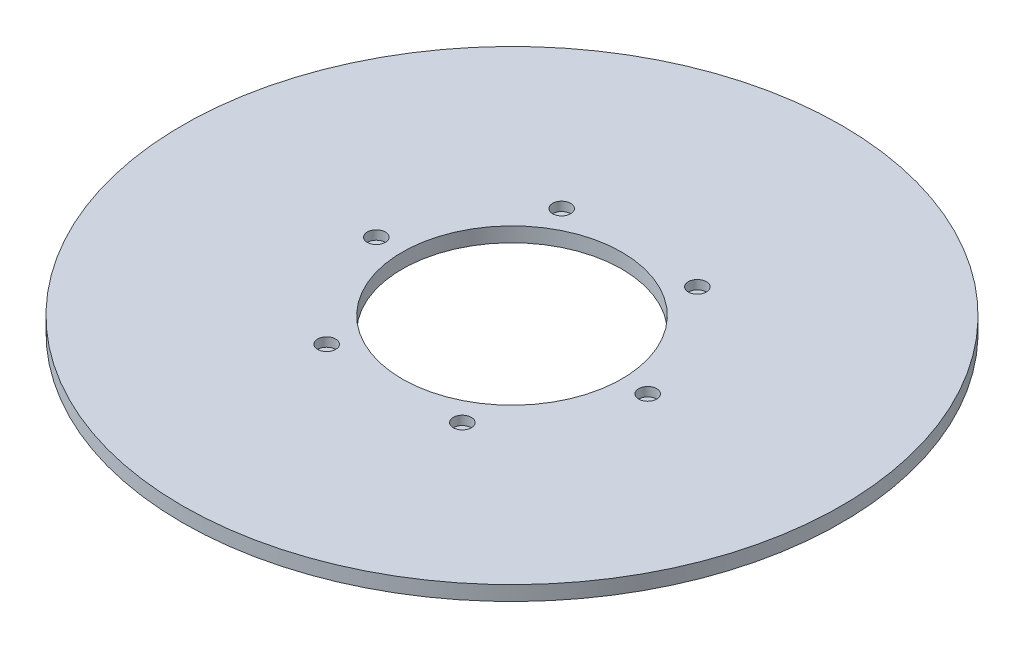
ISO-10303-21;
HEADER;
FILE_DESCRIPTION(('STEP AP214'),'2;1');
FILE_NAME('part.step','',(''),(''),'','','');
FILE_SCHEMA(('AUTOMOTIVE_DESIGN { 1 0 10303 214 1 1 1 1 }'));
ENDSEC;
DATA;
#1=APPLICATION_CONTEXT('core data for automotive mechanical design processes');
#2=APPLICATION_PROTOCOL_DEFINITION('international standard','automotive_design',2000,#1);
#3=PRODUCT_CONTEXT('',#1,'mechanical');
#4=PRODUCT('Part','Part','',(#3));
#5=PRODUCT_RELATED_PRODUCT_CATEGORY('part','',(#4));
#6=PRODUCT_DEFINITION_FORMATION('','',#4);
#7=PRODUCT_DEFINITION_CONTEXT('part definition',#1,'design');
#8=PRODUCT_DEFINITION('design','',#6,#7);
#9=PRODUCT_DEFINITION_SHAPE('','',#8);
#10=(LENGTH_UNIT() NAMED_UNIT(*) SI_UNIT(.MILLI.,.METRE.));
#11=(NAMED_UNIT(*) PLANE_ANGLE_UNIT() SI_UNIT($,.RADIAN.));
#12=(NAMED_UNIT(*) SI_UNIT($,.STERADIAN.) SOLID_ANGLE_UNIT());
#13=UNCERTAINTY_MEASURE_WITH_UNIT(LENGTH_MEASURE(1.E-05),#10,'distance_accuracy_value','');
#14=(GEOMETRIC_REPRESENTATION_CONTEXT(3) GLOBAL_UNCERTAINTY_ASSIGNED_CONTEXT((#13)) GLOBAL_UNIT_ASSIGNED_CONTEXT((#10,
#11,#12)) REPRESENTATION_CONTEXT('',''));
#15=CARTESIAN_POINT('',(0.,0.,0.));
#16=DIRECTION('',(0.,0.,1.));
#17=DIRECTION('',(1.,0.,0.));
#18=AXIS2_PLACEMENT_3D('',#15,#16,#17);
#19=CARTESIAN_POINT('',(0.,4.,0.));
#20=DIRECTION('',(0.,-1.,0.));
#21=DIRECTION('',(0.,0.,-1.));
#22=AXIS2_PLACEMENT_3D('',#19,#20,#21);
#23=CYLINDRICAL_SURFACE('',#22,90.);
#24=CARTESIAN_POINT('',(0.,4.,0.));
#25=DIRECTION('',(0.,1.,0.));
#26=DIRECTION('',(0.,0.,1.));
#27=AXIS2_PLACEMENT_3D('',#24,#25,#26);
#28=CIRCLE('',#27,90.);
#29=CARTESIAN_POINT('',(0.,4.,90.));
#30=VERTEX_POINT('',#29);
#31=EDGE_CURVE('E10',#30,#30,#28,.T.);
#32=ORIENTED_EDGE('',*,*,#31,.F.);
#33=EDGE_LOOP('',(#32));
#34=FACE_BOUND('',#33,.T.);
#35=CARTESIAN_POINT('',(0.,0.,0.));
#36=DIRECTION('',(0.,1.,0.));
#37=DIRECTION('',(0.,0.,1.));
#38=AXIS2_PLACEMENT_3D('',#35,#36,#37);
#39=CIRCLE('',#38,90.);
#40=CARTESIAN_POINT('',(0.,0.,90.));
#41=VERTEX_POINT('',#40);
#42=EDGE_CURVE('E37',#41,#41,#39,.T.);
#43=ORIENTED_EDGE('',*,*,#42,.T.);
#44=EDGE_LOOP('',(#43));
#45=FACE_BOUND('',#44,.T.);
#46=ADVANCED_FACE('F40',(#34,#45),#23,.T.);
#47=CARTESIAN_POINT('',(0.,4.,0.));
#48=DIRECTION('',(0.,1.,0.));
#49=DIRECTION('',(0.,0.,1.));
#50=AXIS2_PLACEMENT_3D('',#47,#48,#49);
#51=PLANE('',#50);
#52=CARTESIAN_POINT('',(-18.5282718116548,4.,-32.0919081542315));
#53=DIRECTION('',(0.,1.,0.));
#54=DIRECTION('',(-0.866025403784433,0.,0.50000000000001));
#55=AXIS2_PLACEMENT_3D('',#52,#53,#54);
#56=CIRCLE('',#55,2.46890591203106);
#57=CARTESIAN_POINT('',(-18.5282718116548,4.,-29.6230022422005));
#58=VERTEX_POINT('',#57);
#59=EDGE_CURVE('E70',#58,#58,#56,.T.);
#60=ORIENTED_EDGE('',*,*,#59,.F.);
#61=EDGE_LOOP('',(#60));
#62=FACE_BOUND('',#61,.T.);
#63=CARTESIAN_POINT('',(18.5282718116542,4.,-32.0919081542319));
#64=DIRECTION('',(0.,1.,0.));
#65=DIRECTION('',(-0.866025403784443,0.,-0.499999999999992));
#66=AXIS2_PLACEMENT_3D('',#63,#64,#65);
#67=CIRCLE('',#66,2.46890591203106);
#68=CARTESIAN_POINT('',(18.5282718116542,4.,-29.6230022422009));
#69=VERTEX_POINT('',#68);
#70=EDGE_CURVE('E71',#69,#69,#67,.T.);
#71=ORIENTED_EDGE('',*,*,#70,.F.);
#72=EDGE_LOOP('',(#71));
#73=FACE_BOUND('',#72,.T.);
#74=CARTESIAN_POINT('',(37.0565436233089,4.,0.));
#75=DIRECTION('',(0.,1.,0.));
#76=DIRECTION('',(0.,0.,-1.));
#77=AXIS2_PLACEMENT_3D('',#74,#75,#76);
#78=CIRCLE('',#77,2.46890591203106);
#79=CARTESIAN_POINT('',(37.0565436233089,4.,2.46890591203106));
#80=VERTEX_POINT('',#79);
#81=EDGE_CURVE('E78',#80,#80,#78,.T.);
#82=ORIENTED_EDGE('',*,*,#81,.F.);
#83=EDGE_LOOP('',(#82));
#84=FACE_BOUND('',#83,.T.);
#85=CARTESIAN_POINT('',(18.5282718116546,4.,32.0919081542317));
#86=DIRECTION('',(0.,1.,0.));
#87=DIRECTION('',(0.866025403784436,0.,-0.500000000000004));
#88=AXIS2_PLACEMENT_3D('',#85,#86,#87);
#89=CIRCLE('',#88,2.46890591203106);
#90=CARTESIAN_POINT('',(18.5282718116546,4.,34.5608140662628));
#91=VERTEX_POINT('',#90);
#92=EDGE_CURVE('E84',#91,#91,#89,.T.);
#93=ORIENTED_EDGE('',*,*,#92,.F.);
#94=EDGE_LOOP('',(#93));
#95=FACE_BOUND('',#94,.T.);
#96=CARTESIAN_POINT('',(-18.5282718116544,4.,32.0919081542318));
#97=DIRECTION('',(0.,1.,0.));
#98=DIRECTION('',(0.86602540378444,0.,0.499999999999998));
#99=AXIS2_PLACEMENT_3D('',#96,#97,#98);
#100=CIRCLE('',#99,2.46890591203106);
#101=CARTESIAN_POINT('',(-18.5282718116544,4.,34.5608140662629));
#102=VERTEX_POINT('',#101);
#103=EDGE_CURVE('E61',#102,#102,#100,.T.);
#104=ORIENTED_EDGE('',*,*,#103,.F.);
#105=EDGE_LOOP('',(#104));
#106=FACE_BOUND('',#105,.T.);
#107=CARTESIAN_POINT('',(-37.0565436233089,4.,0.));
#108=DIRECTION('',(0.,1.,0.));
#109=DIRECTION('',(0.,0.,1.));
#110=AXIS2_PLACEMENT_3D('',#107,#108,#109);
#111=CIRCLE('',#110,2.46890591203106);
#112=CARTESIAN_POINT('',(-37.0565436233089,4.,2.46890591203106));
#113=VERTEX_POINT('',#112);
#114=EDGE_CURVE('E54',#113,#113,#111,.T.);
#115=ORIENTED_EDGE('',*,*,#114,.F.);
#116=EDGE_LOOP('',(#115));
#117=FACE_BOUND('',#116,.T.);
#118=CARTESIAN_POINT('',(0.,4.,0.));
#119=DIRECTION('',(0.,1.,0.));
#120=DIRECTION('',(0.,0.,1.));
#121=AXIS2_PLACEMENT_3D('',#118,#119,#120);
#122=CIRCLE('',#121,30.);
#123=CARTESIAN_POINT('',(0.,4.,30.));
#124=VERTEX_POINT('',#123);
#125=EDGE_CURVE('E50',#124,#124,#122,.T.);
#126=ORIENTED_EDGE('',*,*,#125,.F.);
#127=EDGE_LOOP('',(#126));
#128=FACE_BOUND('',#127,.T.);
#129=ORIENTED_EDGE('',*,*,#31,.T.);
#130=EDGE_LOOP('',(#129));
#131=FACE_BOUND('',#130,.T.);
#132=ADVANCED_FACE('F99',(#62,#73,#84,#95,#106,#117,#128,#131),#51,.T.);
#133=CARTESIAN_POINT('',(0.,0.,0.));
#134=DIRECTION('',(0.,1.,0.));
#135=DIRECTION('',(0.,0.,1.));
#136=AXIS2_PLACEMENT_3D('',#133,#134,#135);
#137=PLANE('',#136);
#138=CARTESIAN_POINT('',(0.,0.,0.));
#139=DIRECTION('',(0.,1.,0.));
#140=DIRECTION('',(0.,0.,1.));
#141=AXIS2_PLACEMENT_3D('',#138,#139,#140);
#142=CIRCLE('',#141,30.);
#143=CARTESIAN_POINT('',(0.,0.,30.));
#144=VERTEX_POINT('',#143);
#145=EDGE_CURVE('E47',#144,#144,#142,.T.);
#146=ORIENTED_EDGE('',*,*,#145,.T.);
#147=EDGE_LOOP('',(#146));
#148=FACE_BOUND('',#147,.T.);
#149=ORIENTED_EDGE('',*,*,#42,.F.);
#150=EDGE_LOOP('',(#149));
#151=FACE_BOUND('',#150,.T.);
#152=ADVANCED_FACE('F103',(#148,#151),#137,.F.);
#153=CARTESIAN_POINT('',(0.,4.,0.));
#154=DIRECTION('',(0.,-1.,0.));
#155=DIRECTION('',(0.,0.,-1.));
#156=AXIS2_PLACEMENT_3D('',#153,#154,#155);
#157=CYLINDRICAL_SURFACE('',#156,30.);
#158=ORIENTED_EDGE('',*,*,#125,.T.);
#159=EDGE_LOOP('',(#158));
#160=FACE_BOUND('',#159,.T.);
#161=ORIENTED_EDGE('',*,*,#145,.F.);
#162=EDGE_LOOP('',(#161));
#163=FACE_BOUND('',#162,.T.);
#164=ADVANCED_FACE('F115',(#160,#163),#157,.F.);
#165=CARTESIAN_POINT('',(-37.0565436233089,1.5405980535547,0.));
#166=DIRECTION('',(0.,1.,0.));
#167=DIRECTION('',(0.,0.,1.));
#168=AXIS2_PLACEMENT_3D('',#165,#166,#167);
#169=CYLINDRICAL_SURFACE('',#168,2.46890591203106);
#170=CARTESIAN_POINT('',(-37.0565436233089,1.5405980535547,0.));
#171=DIRECTION('',(0.,1.,0.));
#172=DIRECTION('',(0.,0.,1.));
#173=AXIS2_PLACEMENT_3D('',#170,#171,#172);
#174=CIRCLE('',#173,2.46890591203106);
#175=CARTESIAN_POINT('',(-37.0565436233089,1.5405980535547,2.46890591203106));
#176=VERTEX_POINT('',#175);
#177=EDGE_CURVE('E55',#176,#176,#174,.T.);
#178=CARTESIAN_POINT('',(-37.0565436233089,1.5405980535547,2.46890591203106));
#179=CARTESIAN_POINT('',(-37.0565436233089,1.56621682383017,2.46890591203106));
#180=CARTESIAN_POINT('',(-37.0565436233089,1.59183559410565,2.46890591203106));
#181=CARTESIAN_POINT('',(-37.0565436233089,1.64307313465659,2.46890591203106));
#182=CARTESIAN_POINT('',(-37.0565436233089,1.66869190493206,2.46890591203106));
#183=CARTESIAN_POINT('',(-37.0565436233089,1.71992944548301,2.46890591203106));
#184=CARTESIAN_POINT('',(-37.0565436233089,1.74554821575848,2.46890591203106));
#185=CARTESIAN_POINT('',(-37.0565436233089,1.79678575630942,2.46890591203106));
#186=CARTESIAN_POINT('',(-37.0565436233089,1.82240452658489,2.46890591203106));
#187=CARTESIAN_POINT('',(-37.0565436233089,1.87364206713584,2.46890591203106));
#188=CARTESIAN_POINT('',(-37.0565436233089,1.89926083741131,2.46890591203106));
#189=CARTESIAN_POINT('',(-37.0565436233089,1.95049837796225,2.46890591203106));
#190=CARTESIAN_POINT('',(-37.0565436233089,1.97611714823772,2.46890591203106));
#191=CARTESIAN_POINT('',(-37.0565436233089,2.02735468878867,2.46890591203106));
#192=CARTESIAN_POINT('',(-37.0565436233089,2.05297345906414,2.46890591203106));
#193=CARTESIAN_POINT('',(-37.0565436233089,2.10421099961508,2.46890591203106));
#194=CARTESIAN_POINT('',(-37.0565436233089,2.12982976989055,2.46890591203106));
#195=CARTESIAN_POINT('',(-37.0565436233089,2.1810673104415,2.46890591203106));
#196=CARTESIAN_POINT('',(-37.0565436233089,2.20668608071697,2.46890591203106));
#197=CARTESIAN_POINT('',(-37.0565436233089,2.25792362126791,2.46890591203106));
#198=CARTESIAN_POINT('',(-37.0565436233089,2.28354239154339,2.46890591203106));
#199=CARTESIAN_POINT('',(-37.0565436233089,2.33477993209433,2.46890591203106));
#200=CARTESIAN_POINT('',(-37.0565436233089,2.3603987023698,2.46890591203106));
#201=CARTESIAN_POINT('',(-37.0565436233089,2.41163624292074,2.46890591203106));
#202=CARTESIAN_POINT('',(-37.0565436233089,2.43725501319622,2.46890591203106));
#203=CARTESIAN_POINT('',(-37.0565436233089,2.48849255374716,2.46890591203106));
#204=CARTESIAN_POINT('',(-37.0565436233089,2.51411132402263,2.46890591203106));
#205=CARTESIAN_POINT('',(-37.0565436233089,2.56534886457358,2.46890591203106));
#206=CARTESIAN_POINT('',(-37.0565436233089,2.59096763484905,2.46890591203106));
#207=CARTESIAN_POINT('',(-37.0565436233089,2.64220517539999,2.46890591203106));
#208=CARTESIAN_POINT('',(-37.0565436233089,2.66782394567546,2.46890591203106));
#209=CARTESIAN_POINT('',(-37.0565436233089,2.71906148622641,2.46890591203106));
#210=CARTESIAN_POINT('',(-37.0565436233089,2.74468025650188,2.46890591203106));
#211=CARTESIAN_POINT('',(-37.0565436233089,2.79591779705282,2.46890591203106));
#212=CARTESIAN_POINT('',(-37.0565436233089,2.82153656732829,2.46890591203106));
#213=CARTESIAN_POINT('',(-37.0565436233089,2.87277410787924,2.46890591203106));
#214=CARTESIAN_POINT('',(-37.0565436233089,2.89839287815471,2.46890591203106));
#215=CARTESIAN_POINT('',(-37.0565436233089,2.94963041870565,2.46890591203106));
#216=CARTESIAN_POINT('',(-37.0565436233089,2.97524918898113,2.46890591203106));
#217=CARTESIAN_POINT('',(-37.0565436233089,3.02648672953207,2.46890591203106));
#218=CARTESIAN_POINT('',(-37.0565436233089,3.05210549980754,2.46890591203106));
#219=CARTESIAN_POINT('',(-37.0565436233089,3.10334304035848,2.46890591203106));
#220=CARTESIAN_POINT('',(-37.0565436233089,3.12896181063396,2.46890591203106));
#221=CARTESIAN_POINT('',(-37.0565436233089,3.1801993511849,2.46890591203106));
#222=CARTESIAN_POINT('',(-37.0565436233089,3.20581812146037,2.46890591203106));
#223=CARTESIAN_POINT('',(-37.0565436233089,3.25705566201132,2.46890591203106));
#224=CARTESIAN_POINT('',(-37.0565436233089,3.28267443228679,2.46890591203106));
#225=CARTESIAN_POINT('',(-37.0565436233089,3.33391197283773,2.46890591203106));
#226=CARTESIAN_POINT('',(-37.0565436233089,3.3595307431132,2.46890591203106));
#227=CARTESIAN_POINT('',(-37.0565436233089,3.41076828366415,2.46890591203106));
#228=CARTESIAN_POINT('',(-37.0565436233089,3.43638705393962,2.46890591203106));
#229=CARTESIAN_POINT('',(-37.0565436233089,3.48762459449056,2.46890591203106));
#230=CARTESIAN_POINT('',(-37.0565436233089,3.51324336476603,2.46890591203106));
#231=CARTESIAN_POINT('',(-37.0565436233089,3.56448090531698,2.46890591203106));
#232=CARTESIAN_POINT('',(-37.0565436233089,3.59009967559245,2.46890591203106));
#233=CARTESIAN_POINT('',(-37.0565436233089,3.64133721614339,2.46890591203106));
#234=CARTESIAN_POINT('',(-37.0565436233089,3.66695598641887,2.46890591203106));
#235=CARTESIAN_POINT('',(-37.0565436233089,3.71819352696981,2.46890591203106));
#236=CARTESIAN_POINT('',(-37.0565436233089,3.74381229724528,2.46890591203106));
#237=CARTESIAN_POINT('',(-37.0565436233089,3.79504983779622,2.46890591203106));
#238=CARTESIAN_POINT('',(-37.0565436233089,3.8206686080717,2.46890591203106));
#239=CARTESIAN_POINT('',(-37.0565436233089,3.87190614862264,2.46890591203106));
#240=CARTESIAN_POINT('',(-37.0565436233089,3.89752491889811,2.46890591203106));
#241=CARTESIAN_POINT('',(-37.0565436233089,3.94876245944906,2.46890591203106));
#242=CARTESIAN_POINT('',(-37.0565436233089,3.97438122972453,2.46890591203106));
#243=CARTESIAN_POINT('',(-37.0565436233089,4.,2.46890591203106));
#244=B_SPLINE_CURVE_WITH_KNOTS('',3,(#178,#179,#180,#181,#182,#183,#184,#185,#186,#187,#188,
#189,#190,#191,#192,#193,#194,#195,#196,#197,#198,#199,#200,#201,#202,#203,#204,#205,#206,#207,
#208,#209,#210,#211,#212,#213,#214,#215,#216,#217,#218,#219,#220,#221,#222,#223,#224,#225,#226,
#227,#228,#229,#230,#231,#232,#233,#234,#235,#236,#237,#238,#239,#240,#241,#242,#243),
.UNSPECIFIED.,.F.,.F.,(4,2,2,2,2,2,2,2,2,2,2,2,2,2,2,2,2,2,2,2,2,2,2,2,2,2,2,2,2,2,2,2,4),(0.,
0.0768563108264155,0.153712621652831,0.230568932479247,0.307425243305662,0.384281554132078,
0.461137864958493,0.537994175784909,0.614850486611324,0.69170679743774,0.768563108264155,
0.845419419090571,0.922275729916986,0.999132040743402,1.07598835156982,1.15284466239623,
1.22970097322265,1.30655728404906,1.38341359487548,1.46026990570189,1.53712621652831,
1.61398252735473,1.69083883818114,1.76769514900756,1.84455145983397,1.92140777066039,
1.9982640814868,2.07512039231322,2.15197670313963,2.22883301396605,2.30568932479247,
2.38254563561888,2.4594019464453),.UNSPECIFIED.);
#245=EDGE_CURVE('BSEAM113',#176,#113,#244,.T.);
#246=ORIENTED_EDGE('',*,*,#177,.F.);
#247=ORIENTED_EDGE('',*,*,#114,.T.);
#248=ORIENTED_EDGE('',*,*,#245,.T.);
#249=ORIENTED_EDGE('',*,*,#245,.F.);
#250=EDGE_LOOP('',(#246,#248,#247,#249));
#251=FACE_BOUND('',#250,.T.);
#252=ADVANCED_FACE('F113',(#251),#169,.F.);
#253=CARTESIAN_POINT('',(-37.0565436233089,1.5405980535547,0.));
#254=DIRECTION('',(0.,1.,0.));
#255=DIRECTION('',(0.,0.,1.));
#256=AXIS2_PLACEMENT_3D('',#253,#254,#255);
#257=PLANE('',#256);
#258=ORIENTED_EDGE('',*,*,#177,.T.);
#259=EDGE_LOOP('',(#258));
#260=FACE_BOUND('',#259,.T.);
#261=ADVANCED_FACE('F144',(#260),#257,.T.);
#262=CARTESIAN_POINT('',(-18.5282718116544,1.5405980535547,32.0919081542318));
#263=DIRECTION('',(0.,1.,0.));
#264=DIRECTION('',(0.,0.,1.));
#265=AXIS2_PLACEMENT_3D('',#262,#263,#264);
#266=CYLINDRICAL_SURFACE('',#265,2.46890591203106);
#267=CARTESIAN_POINT('',(-18.5282718116544,1.5405980535547,32.0919081542318));
#268=DIRECTION('',(0.,1.,0.));
#269=DIRECTION('',(0.86602540378444,0.,0.499999999999998));
#270=AXIS2_PLACEMENT_3D('',#267,#268,#269);
#271=CIRCLE('',#270,2.46890591203106);
#272=CARTESIAN_POINT('',(-18.5282718116544,1.5405980535547,34.5608140662629));
#273=VERTEX_POINT('',#272);
#274=EDGE_CURVE('E59',#273,#273,#271,.T.);
#275=CARTESIAN_POINT('',(-18.5282718116544,1.5405980535547,34.5608140662629));
#276=CARTESIAN_POINT('',(-18.5282718116544,1.56621682383017,34.5608140662629));
#277=CARTESIAN_POINT('',(-18.5282718116544,1.59183559410565,34.5608140662629));
#278=CARTESIAN_POINT('',(-18.5282718116544,1.64307313465659,34.5608140662629));
#279=CARTESIAN_POINT('',(-18.5282718116544,1.66869190493206,34.5608140662629));
#280=CARTESIAN_POINT('',(-18.5282718116544,1.71992944548301,34.5608140662629));
#281=CARTESIAN_POINT('',(-18.5282718116544,1.74554821575848,34.5608140662629));
#282=CARTESIAN_POINT('',(-18.5282718116544,1.79678575630942,34.5608140662629));
#283=CARTESIAN_POINT('',(-18.5282718116544,1.82240452658489,34.5608140662629));
#284=CARTESIAN_POINT('',(-18.5282718116544,1.87364206713584,34.5608140662629));
#285=CARTESIAN_POINT('',(-18.5282718116544,1.89926083741131,34.5608140662629));
#286=CARTESIAN_POINT('',(-18.5282718116544,1.95049837796225,34.5608140662629));
#287=CARTESIAN_POINT('',(-18.5282718116544,1.97611714823772,34.5608140662629));
#288=CARTESIAN_POINT('',(-18.5282718116544,2.02735468878867,34.5608140662629));
#289=CARTESIAN_POINT('',(-18.5282718116544,2.05297345906414,34.5608140662629));
#290=CARTESIAN_POINT('',(-18.5282718116544,2.10421099961508,34.5608140662629));
#291=CARTESIAN_POINT('',(-18.5282718116544,2.12982976989055,34.5608140662629));
#292=CARTESIAN_POINT('',(-18.5282718116544,2.1810673104415,34.5608140662629));
#293=CARTESIAN_POINT('',(-18.5282718116544,2.20668608071697,34.5608140662629));
#294=CARTESIAN_POINT('',(-18.5282718116544,2.25792362126791,34.5608140662629));
#295=CARTESIAN_POINT('',(-18.5282718116544,2.28354239154339,34.5608140662629));
#296=CARTESIAN_POINT('',(-18.5282718116544,2.33477993209433,34.5608140662629));
#297=CARTESIAN_POINT('',(-18.5282718116544,2.3603987023698,34.5608140662629));
#298=CARTESIAN_POINT('',(-18.5282718116544,2.41163624292074,34.5608140662629));
#299=CARTESIAN_POINT('',(-18.5282718116544,2.43725501319622,34.5608140662629));
#300=CARTESIAN_POINT('',(-18.5282718116544,2.48849255374716,34.5608140662629));
#301=CARTESIAN_POINT('',(-18.5282718116544,2.51411132402263,34.5608140662629));
#302=CARTESIAN_POINT('',(-18.5282718116544,2.56534886457358,34.5608140662629));
#303=CARTESIAN_POINT('',(-18.5282718116544,2.59096763484905,34.5608140662629));
#304=CARTESIAN_POINT('',(-18.5282718116544,2.64220517539999,34.5608140662629));
#305=CARTESIAN_POINT('',(-18.5282718116544,2.66782394567546,34.5608140662629));
#306=CARTESIAN_POINT('',(-18.5282718116544,2.71906148622641,34.5608140662629));
#307=CARTESIAN_POINT('',(-18.5282718116544,2.74468025650188,34.5608140662629));
#308=CARTESIAN_POINT('',(-18.5282718116544,2.79591779705282,34.5608140662629));
#309=CARTESIAN_POINT('',(-18.5282718116544,2.82153656732829,34.5608140662629));
#310=CARTESIAN_POINT('',(-18.5282718116544,2.87277410787924,34.5608140662629));
#311=CARTESIAN_POINT('',(-18.5282718116544,2.89839287815471,34.5608140662629));
#312=CARTESIAN_POINT('',(-18.5282718116544,2.94963041870565,34.5608140662629));
#313=CARTESIAN_POINT('',(-18.5282718116544,2.97524918898113,34.5608140662629));
#314=CARTESIAN_POINT('',(-18.5282718116544,3.02648672953207,34.5608140662629));
#315=CARTESIAN_POINT('',(-18.5282718116544,3.05210549980754,34.5608140662629));
#316=CARTESIAN_POINT('',(-18.5282718116544,3.10334304035848,34.5608140662629));
#317=CARTESIAN_POINT('',(-18.5282718116544,3.12896181063396,34.5608140662629));
#318=CARTESIAN_POINT('',(-18.5282718116544,3.1801993511849,34.5608140662629));
#319=CARTESIAN_POINT('',(-18.5282718116544,3.20581812146037,34.5608140662629));
#320=CARTESIAN_POINT('',(-18.5282718116544,3.25705566201132,34.5608140662629));
#321=CARTESIAN_POINT('',(-18.5282718116544,3.28267443228679,34.5608140662629));
#322=CARTESIAN_POINT('',(-18.5282718116544,3.33391197283773,34.5608140662629));
#323=CARTESIAN_POINT('',(-18.5282718116544,3.3595307431132,34.5608140662629));
#324=CARTESIAN_POINT('',(-18.5282718116544,3.41076828366415,34.5608140662629));
#325=CARTESIAN_POINT('',(-18.5282718116544,3.43638705393962,34.5608140662629));
#326=CARTESIAN_POINT('',(-18.5282718116544,3.48762459449056,34.5608140662629));
#327=CARTESIAN_POINT('',(-18.5282718116544,3.51324336476603,34.5608140662629));
#328=CARTESIAN_POINT('',(-18.5282718116544,3.56448090531698,34.5608140662629));
#329=CARTESIAN_POINT('',(-18.5282718116544,3.59009967559245,34.5608140662629));
#330=CARTESIAN_POINT('',(-18.5282718116544,3.64133721614339,34.5608140662629));
#331=CARTESIAN_POINT('',(-18.5282718116544,3.66695598641887,34.5608140662629));
#332=CARTESIAN_POINT('',(-18.5282718116544,3.71819352696981,34.5608140662629));
#333=CARTESIAN_POINT('',(-18.5282718116544,3.74381229724528,34.5608140662629));
#334=CARTESIAN_POINT('',(-18.5282718116544,3.79504983779622,34.5608140662629));
#335=CARTESIAN_POINT('',(-18.5282718116544,3.8206686080717,34.5608140662629));
#336=CARTESIAN_POINT('',(-18.5282718116544,3.87190614862264,34.5608140662629));
#337=CARTESIAN_POINT('',(-18.5282718116544,3.89752491889811,34.5608140662629));
#338=CARTESIAN_POINT('',(-18.5282718116544,3.94876245944906,34.5608140662629));
#339=CARTESIAN_POINT('',(-18.5282718116544,3.97438122972453,34.5608140662629));
#340=CARTESIAN_POINT('',(-18.5282718116544,4.,34.5608140662629));
#341=B_SPLINE_CURVE_WITH_KNOTS('',3,(#275,#276,#277,#278,#279,#280,#281,#282,#283,#284,#285,
#286,#287,#288,#289,#290,#291,#292,#293,#294,#295,#296,#297,#298,#299,#300,#301,#302,#303,#304,
#305,#306,#307,#308,#309,#310,#311,#312,#313,#314,#315,#316,#317,#318,#319,#320,#321,#322,#323,
#324,#325,#326,#327,#328,#329,#330,#331,#332,#333,#334,#335,#336,#337,#338,#339,#340),
.UNSPECIFIED.,.F.,.F.,(4,2,2,2,2,2,2,2,2,2,2,2,2,2,2,2,2,2,2,2,2,2,2,2,2,2,2,2,2,2,2,2,4),(0.,
0.0768563108264155,0.153712621652831,0.230568932479247,0.307425243305662,0.384281554132078,
0.461137864958493,0.537994175784909,0.614850486611324,0.69170679743774,0.768563108264155,
0.845419419090571,0.922275729916986,0.999132040743402,1.07598835156982,1.15284466239623,
1.22970097322265,1.30655728404906,1.38341359487548,1.46026990570189,1.53712621652831,
1.61398252735473,1.69083883818114,1.76769514900756,1.84455145983397,1.92140777066039,
1.9982640814868,2.07512039231322,2.15197670313963,2.22883301396605,2.30568932479247,
2.38254563561888,2.4594019464453),.UNSPECIFIED.);
#342=EDGE_CURVE('BSEAM153',#273,#102,#341,.T.);
#343=ORIENTED_EDGE('',*,*,#274,.F.);
#344=ORIENTED_EDGE('',*,*,#103,.T.);
#345=ORIENTED_EDGE('',*,*,#342,.T.);
#346=ORIENTED_EDGE('',*,*,#342,.F.);
#347=EDGE_LOOP('',(#343,#345,#344,#346));
#348=FACE_BOUND('',#347,.T.);
#349=ADVANCED_FACE('F153',(#348),#266,.F.);
#350=CARTESIAN_POINT('',(-18.5282718116544,1.5405980535547,32.0919081542318));
#351=DIRECTION('',(0.,1.,0.));
#352=DIRECTION('',(0.86602540378444,0.,0.499999999999998));
#353=AXIS2_PLACEMENT_3D('',#350,#351,#352);
#354=PLANE('',#353);
#355=ORIENTED_EDGE('',*,*,#274,.T.);
#356=EDGE_LOOP('',(#355));
#357=FACE_BOUND('',#356,.T.);
#358=ADVANCED_FACE('F96',(#357),#354,.T.);
#359=CARTESIAN_POINT('',(18.5282718116546,1.5405980535547,32.0919081542317));
#360=DIRECTION('',(0.,1.,0.));
#361=DIRECTION('',(0.,0.,1.));
#362=AXIS2_PLACEMENT_3D('',#359,#360,#361);
#363=CYLINDRICAL_SURFACE('',#362,2.46890591203106);
#364=CARTESIAN_POINT('',(18.5282718116546,1.5405980535547,32.0919081542317));
#365=DIRECTION('',(0.,1.,0.));
#366=DIRECTION('',(0.866025403784436,0.,-0.500000000000004));
#367=AXIS2_PLACEMENT_3D('',#364,#365,#366);
#368=CIRCLE('',#367,2.46890591203106);
#369=CARTESIAN_POINT('',(18.5282718116546,1.5405980535547,34.5608140662628));
#370=VERTEX_POINT('',#369);
#371=EDGE_CURVE('E63',#370,#370,#368,.T.);
#372=CARTESIAN_POINT('',(18.5282718116546,1.5405980535547,34.5608140662628));
#373=CARTESIAN_POINT('',(18.5282718116546,1.56621682383017,34.5608140662628));
#374=CARTESIAN_POINT('',(18.5282718116546,1.59183559410565,34.5608140662628));
#375=CARTESIAN_POINT('',(18.5282718116546,1.64307313465659,34.5608140662628));
#376=CARTESIAN_POINT('',(18.5282718116546,1.66869190493206,34.5608140662628));
#377=CARTESIAN_POINT('',(18.5282718116546,1.71992944548301,34.5608140662628));
#378=CARTESIAN_POINT('',(18.5282718116546,1.74554821575848,34.5608140662628));
#379=CARTESIAN_POINT('',(18.5282718116546,1.79678575630942,34.5608140662628));
#380=CARTESIAN_POINT('',(18.5282718116546,1.82240452658489,34.5608140662628));
#381=CARTESIAN_POINT('',(18.5282718116546,1.87364206713584,34.5608140662628));
#382=CARTESIAN_POINT('',(18.5282718116546,1.89926083741131,34.5608140662628));
#383=CARTESIAN_POINT('',(18.5282718116546,1.95049837796225,34.5608140662628));
#384=CARTESIAN_POINT('',(18.5282718116546,1.97611714823772,34.5608140662628));
#385=CARTESIAN_POINT('',(18.5282718116546,2.02735468878867,34.5608140662628));
#386=CARTESIAN_POINT('',(18.5282718116546,2.05297345906414,34.5608140662628));
#387=CARTESIAN_POINT('',(18.5282718116546,2.10421099961508,34.5608140662628));
#388=CARTESIAN_POINT('',(18.5282718116546,2.12982976989055,34.5608140662628));
#389=CARTESIAN_POINT('',(18.5282718116546,2.1810673104415,34.5608140662628));
#390=CARTESIAN_POINT('',(18.5282718116546,2.20668608071697,34.5608140662628));
#391=CARTESIAN_POINT('',(18.5282718116546,2.25792362126791,34.5608140662628));
#392=CARTESIAN_POINT('',(18.5282718116546,2.28354239154339,34.5608140662628));
#393=CARTESIAN_POINT('',(18.5282718116546,2.33477993209433,34.5608140662628));
#394=CARTESIAN_POINT('',(18.5282718116546,2.3603987023698,34.5608140662628));
#395=CARTESIAN_POINT('',(18.5282718116546,2.41163624292074,34.5608140662628));
#396=CARTESIAN_POINT('',(18.5282718116546,2.43725501319622,34.5608140662628));
#397=CARTESIAN_POINT('',(18.5282718116546,2.48849255374716,34.5608140662628));
#398=CARTESIAN_POINT('',(18.5282718116546,2.51411132402263,34.5608140662628));
#399=CARTESIAN_POINT('',(18.5282718116546,2.56534886457358,34.5608140662628));
#400=CARTESIAN_POINT('',(18.5282718116546,2.59096763484905,34.5608140662628));
#401=CARTESIAN_POINT('',(18.5282718116546,2.64220517539999,34.5608140662628));
#402=CARTESIAN_POINT('',(18.5282718116546,2.66782394567546,34.5608140662628));
#403=CARTESIAN_POINT('',(18.5282718116546,2.71906148622641,34.5608140662628));
#404=CARTESIAN_POINT('',(18.5282718116546,2.74468025650188,34.5608140662628));
#405=CARTESIAN_POINT('',(18.5282718116546,2.79591779705282,34.5608140662628));
#406=CARTESIAN_POINT('',(18.5282718116546,2.82153656732829,34.5608140662628));
#407=CARTESIAN_POINT('',(18.5282718116546,2.87277410787924,34.5608140662628));
#408=CARTESIAN_POINT('',(18.5282718116546,2.89839287815471,34.5608140662628));
#409=CARTESIAN_POINT('',(18.5282718116546,2.94963041870565,34.5608140662628));
#410=CARTESIAN_POINT('',(18.5282718116546,2.97524918898113,34.5608140662628));
#411=CARTESIAN_POINT('',(18.5282718116546,3.02648672953207,34.5608140662628));
#412=CARTESIAN_POINT('',(18.5282718116546,3.05210549980754,34.5608140662628));
#413=CARTESIAN_POINT('',(18.5282718116546,3.10334304035848,34.5608140662628));
#414=CARTESIAN_POINT('',(18.5282718116546,3.12896181063396,34.5608140662628));
#415=CARTESIAN_POINT('',(18.5282718116546,3.1801993511849,34.5608140662628));
#416=CARTESIAN_POINT('',(18.5282718116546,3.20581812146037,34.5608140662628));
#417=CARTESIAN_POINT('',(18.5282718116546,3.25705566201132,34.5608140662628));
#418=CARTESIAN_POINT('',(18.5282718116546,3.28267443228679,34.5608140662628));
#419=CARTESIAN_POINT('',(18.5282718116546,3.33391197283773,34.5608140662628));
#420=CARTESIAN_POINT('',(18.5282718116546,3.3595307431132,34.5608140662628));
#421=CARTESIAN_POINT('',(18.5282718116546,3.41076828366415,34.5608140662628));
#422=CARTESIAN_POINT('',(18.5282718116546,3.43638705393962,34.5608140662628));
#423=CARTESIAN_POINT('',(18.5282718116546,3.48762459449056,34.5608140662628));
#424=CARTESIAN_POINT('',(18.5282718116546,3.51324336476603,34.5608140662628));
#425=CARTESIAN_POINT('',(18.5282718116546,3.56448090531698,34.5608140662628));
#426=CARTESIAN_POINT('',(18.5282718116546,3.59009967559245,34.5608140662628));
#427=CARTESIAN_POINT('',(18.5282718116546,3.64133721614339,34.5608140662628));
#428=CARTESIAN_POINT('',(18.5282718116546,3.66695598641887,34.5608140662628));
#429=CARTESIAN_POINT('',(18.5282718116546,3.71819352696981,34.5608140662628));
#430=CARTESIAN_POINT('',(18.5282718116546,3.74381229724528,34.5608140662628));
#431=CARTESIAN_POINT('',(18.5282718116546,3.79504983779622,34.5608140662628));
#432=CARTESIAN_POINT('',(18.5282718116546,3.8206686080717,34.5608140662628));
#433=CARTESIAN_POINT('',(18.5282718116546,3.87190614862264,34.5608140662628));
#434=CARTESIAN_POINT('',(18.5282718116546,3.89752491889811,34.5608140662628));
#435=CARTESIAN_POINT('',(18.5282718116546,3.94876245944906,34.5608140662628));
#436=CARTESIAN_POINT('',(18.5282718116546,3.97438122972453,34.5608140662628));
#437=CARTESIAN_POINT('',(18.5282718116546,4.,34.5608140662628));
#438=B_SPLINE_CURVE_WITH_KNOTS('',3,(#372,#373,#374,#375,#376,#377,#378,#379,#380,#381,#382,
#383,#384,#385,#386,#387,#388,#389,#390,#391,#392,#393,#394,#395,#396,#397,#398,#399,#400,#401,
#402,#403,#404,#405,#406,#407,#408,#409,#410,#411,#412,#413,#414,#415,#416,#417,#418,#419,#420,
#421,#422,#423,#424,#425,#426,#427,#428,#429,#430,#431,#432,#433,#434,#435,#436,#437),
.UNSPECIFIED.,.F.,.F.,(4,2,2,2,2,2,2,2,2,2,2,2,2,2,2,2,2,2,2,2,2,2,2,2,2,2,2,2,2,2,2,2,4),(0.,
0.0768563108264155,0.153712621652831,0.230568932479247,0.307425243305662,0.384281554132078,
0.461137864958493,0.537994175784909,0.614850486611324,0.69170679743774,0.768563108264155,
0.845419419090571,0.922275729916986,0.999132040743402,1.07598835156982,1.15284466239623,
1.22970097322265,1.30655728404906,1.38341359487548,1.46026990570189,1.53712621652831,
1.61398252735473,1.69083883818114,1.76769514900756,1.84455145983397,1.92140777066039,
1.9982640814868,2.07512039231322,2.15197670313963,2.22883301396605,2.30568932479247,
2.38254563561888,2.4594019464453),.UNSPECIFIED.);
#439=EDGE_CURVE('BSEAM91',#370,#91,#438,.T.);
#440=ORIENTED_EDGE('',*,*,#371,.F.);
#441=ORIENTED_EDGE('',*,*,#92,.T.);
#442=ORIENTED_EDGE('',*,*,#439,.T.);
#443=ORIENTED_EDGE('',*,*,#439,.F.);
#444=EDGE_LOOP('',(#440,#442,#441,#443));
#445=FACE_BOUND('',#444,.T.);
#446=ADVANCED_FACE('F91',(#445),#363,.F.);
#447=CARTESIAN_POINT('',(18.5282718116546,1.5405980535547,32.0919081542317));
#448=DIRECTION('',(0.,1.,0.));
#449=DIRECTION('',(0.866025403784436,0.,-0.500000000000004));
#450=AXIS2_PLACEMENT_3D('',#447,#448,#449);
#451=PLANE('',#450);
#452=ORIENTED_EDGE('',*,*,#371,.T.);
#453=EDGE_LOOP('',(#452));
#454=FACE_BOUND('',#453,.T.);
#455=ADVANCED_FACE('F93',(#454),#451,.T.);
#456=CARTESIAN_POINT('',(37.0565436233089,1.5405980535547,0.));
#457=DIRECTION('',(0.,1.,0.));
#458=DIRECTION('',(0.,0.,1.));
#459=AXIS2_PLACEMENT_3D('',#456,#457,#458);
#460=CYLINDRICAL_SURFACE('',#459,2.46890591203106);
#461=CARTESIAN_POINT('',(37.0565436233089,1.5405980535547,0.));
#462=DIRECTION('',(0.,1.,0.));
#463=DIRECTION('',(0.,0.,-1.));
#464=AXIS2_PLACEMENT_3D('',#461,#462,#463);
#465=CIRCLE('',#464,2.46890591203106);
#466=CARTESIAN_POINT('',(37.0565436233089,1.5405980535547,2.46890591203106));
#467=VERTEX_POINT('',#466);
#468=EDGE_CURVE('E85',#467,#467,#465,.T.);
#469=CARTESIAN_POINT('',(37.0565436233089,1.5405980535547,2.46890591203106));
#470=CARTESIAN_POINT('',(37.0565436233089,1.56621682383017,2.46890591203106));
#471=CARTESIAN_POINT('',(37.0565436233089,1.59183559410565,2.46890591203106));
#472=CARTESIAN_POINT('',(37.0565436233089,1.64307313465659,2.46890591203106));
#473=CARTESIAN_POINT('',(37.0565436233089,1.66869190493206,2.46890591203106));
#474=CARTESIAN_POINT('',(37.0565436233089,1.71992944548301,2.46890591203106));
#475=CARTESIAN_POINT('',(37.0565436233089,1.74554821575848,2.46890591203106));
#476=CARTESIAN_POINT('',(37.0565436233089,1.79678575630942,2.46890591203106));
#477=CARTESIAN_POINT('',(37.0565436233089,1.82240452658489,2.46890591203106));
#478=CARTESIAN_POINT('',(37.0565436233089,1.87364206713584,2.46890591203106));
#479=CARTESIAN_POINT('',(37.0565436233089,1.89926083741131,2.46890591203106));
#480=CARTESIAN_POINT('',(37.0565436233089,1.95049837796225,2.46890591203106));
#481=CARTESIAN_POINT('',(37.0565436233089,1.97611714823772,2.46890591203106));
#482=CARTESIAN_POINT('',(37.0565436233089,2.02735468878867,2.46890591203106));
#483=CARTESIAN_POINT('',(37.0565436233089,2.05297345906414,2.46890591203106));
#484=CARTESIAN_POINT('',(37.0565436233089,2.10421099961508,2.46890591203106));
#485=CARTESIAN_POINT('',(37.0565436233089,2.12982976989055,2.46890591203106));
#486=CARTESIAN_POINT('',(37.0565436233089,2.1810673104415,2.46890591203106));
#487=CARTESIAN_POINT('',(37.0565436233089,2.20668608071697,2.46890591203106));
#488=CARTESIAN_POINT('',(37.0565436233089,2.25792362126791,2.46890591203106));
#489=CARTESIAN_POINT('',(37.0565436233089,2.28354239154339,2.46890591203106));
#490=CARTESIAN_POINT('',(37.0565436233089,2.33477993209433,2.46890591203106));
#491=CARTESIAN_POINT('',(37.0565436233089,2.3603987023698,2.46890591203106));
#492=CARTESIAN_POINT('',(37.0565436233089,2.41163624292074,2.46890591203106));
#493=CARTESIAN_POINT('',(37.0565436233089,2.43725501319622,2.46890591203106));
#494=CARTESIAN_POINT('',(37.0565436233089,2.48849255374716,2.46890591203106));
#495=CARTESIAN_POINT('',(37.0565436233089,2.51411132402263,2.46890591203106));
#496=CARTESIAN_POINT('',(37.0565436233089,2.56534886457358,2.46890591203106));
#497=CARTESIAN_POINT('',(37.0565436233089,2.59096763484905,2.46890591203106));
#498=CARTESIAN_POINT('',(37.0565436233089,2.64220517539999,2.46890591203106));
#499=CARTESIAN_POINT('',(37.0565436233089,2.66782394567546,2.46890591203106));
#500=CARTESIAN_POINT('',(37.0565436233089,2.71906148622641,2.46890591203106));
#501=CARTESIAN_POINT('',(37.0565436233089,2.74468025650188,2.46890591203106));
#502=CARTESIAN_POINT('',(37.0565436233089,2.79591779705282,2.46890591203106));
#503=CARTESIAN_POINT('',(37.0565436233089,2.82153656732829,2.46890591203106));
#504=CARTESIAN_POINT('',(37.0565436233089,2.87277410787924,2.46890591203106));
#505=CARTESIAN_POINT('',(37.0565436233089,2.89839287815471,2.46890591203106));
#506=CARTESIAN_POINT('',(37.0565436233089,2.94963041870565,2.46890591203106));
#507=CARTESIAN_POINT('',(37.0565436233089,2.97524918898113,2.46890591203106));
#508=CARTESIAN_POINT('',(37.0565436233089,3.02648672953207,2.46890591203106));
#509=CARTESIAN_POINT('',(37.0565436233089,3.05210549980754,2.46890591203106));
#510=CARTESIAN_POINT('',(37.0565436233089,3.10334304035848,2.46890591203106));
#511=CARTESIAN_POINT('',(37.0565436233089,3.12896181063396,2.46890591203106));
#512=CARTESIAN_POINT('',(37.0565436233089,3.1801993511849,2.46890591203106));
#513=CARTESIAN_POINT('',(37.0565436233089,3.20581812146037,2.46890591203106));
#514=CARTESIAN_POINT('',(37.0565436233089,3.25705566201132,2.46890591203106));
#515=CARTESIAN_POINT('',(37.0565436233089,3.28267443228679,2.46890591203106));
#516=CARTESIAN_POINT('',(37.0565436233089,3.33391197283773,2.46890591203106));
#517=CARTESIAN_POINT('',(37.0565436233089,3.3595307431132,2.46890591203106));
#518=CARTESIAN_POINT('',(37.0565436233089,3.41076828366415,2.46890591203106));
#519=CARTESIAN_POINT('',(37.0565436233089,3.43638705393962,2.46890591203106));
#520=CARTESIAN_POINT('',(37.0565436233089,3.48762459449056,2.46890591203106));
#521=CARTESIAN_POINT('',(37.0565436233089,3.51324336476603,2.46890591203106));
#522=CARTESIAN_POINT('',(37.0565436233089,3.56448090531698,2.46890591203106));
#523=CARTESIAN_POINT('',(37.0565436233089,3.59009967559245,2.46890591203106));
#524=CARTESIAN_POINT('',(37.0565436233089,3.64133721614339,2.46890591203106));
#525=CARTESIAN_POINT('',(37.0565436233089,3.66695598641887,2.46890591203106));
#526=CARTESIAN_POINT('',(37.0565436233089,3.71819352696981,2.46890591203106));
#527=CARTESIAN_POINT('',(37.0565436233089,3.74381229724528,2.46890591203106));
#528=CARTESIAN_POINT('',(37.0565436233089,3.79504983779622,2.46890591203106));
#529=CARTESIAN_POINT('',(37.0565436233089,3.8206686080717,2.46890591203106));
#530=CARTESIAN_POINT('',(37.0565436233089,3.87190614862264,2.46890591203106));
#531=CARTESIAN_POINT('',(37.0565436233089,3.89752491889811,2.46890591203106));
#532=CARTESIAN_POINT('',(37.0565436233089,3.94876245944906,2.46890591203106));
#533=CARTESIAN_POINT('',(37.0565436233089,3.97438122972453,2.46890591203106));
#534=CARTESIAN_POINT('',(37.0565436233089,4.,2.46890591203106));
#535=B_SPLINE_CURVE_WITH_KNOTS('',3,(#469,#470,#471,#472,#473,#474,#475,#476,#477,#478,#479,
#480,#481,#482,#483,#484,#485,#486,#487,#488,#489,#490,#491,#492,#493,#494,#495,#496,#497,#498,
#499,#500,#501,#502,#503,#504,#505,#506,#507,#508,#509,#510,#511,#512,#513,#514,#515,#516,#517,
#518,#519,#520,#521,#522,#523,#524,#525,#526,#527,#528,#529,#530,#531,#532,#533,#534),
.UNSPECIFIED.,.F.,.F.,(4,2,2,2,2,2,2,2,2,2,2,2,2,2,2,2,2,2,2,2,2,2,2,2,2,2,2,2,2,2,2,2,4),(0.,
0.0768563108264155,0.153712621652831,0.230568932479247,0.307425243305662,0.384281554132078,
0.461137864958493,0.537994175784909,0.614850486611324,0.69170679743774,0.768563108264155,
0.845419419090571,0.922275729916986,0.999132040743402,1.07598835156982,1.15284466239623,
1.22970097322265,1.30655728404906,1.38341359487548,1.46026990570189,1.53712621652831,
1.61398252735473,1.69083883818114,1.76769514900756,1.84455145983397,1.92140777066039,
1.9982640814868,2.07512039231322,2.15197670313963,2.22883301396605,2.30568932479247,
2.38254563561888,2.4594019464453),.UNSPECIFIED.);
#536=EDGE_CURVE('BSEAM187',#467,#80,#535,.T.);
#537=ORIENTED_EDGE('',*,*,#468,.F.);
#538=ORIENTED_EDGE('',*,*,#81,.T.);
#539=ORIENTED_EDGE('',*,*,#536,.T.);
#540=ORIENTED_EDGE('',*,*,#536,.F.);
#541=EDGE_LOOP('',(#537,#539,#538,#540));
#542=FACE_BOUND('',#541,.T.);
#543=ADVANCED_FACE('F187',(#542),#460,.F.);
#544=CARTESIAN_POINT('',(37.0565436233089,1.5405980535547,0.));
#545=DIRECTION('',(0.,1.,0.));
#546=DIRECTION('',(0.,0.,-1.));
#547=AXIS2_PLACEMENT_3D('',#544,#545,#546);
#548=PLANE('',#547);
#549=ORIENTED_EDGE('',*,*,#468,.T.);
#550=EDGE_LOOP('',(#549));
#551=FACE_BOUND('',#550,.T.);
#552=ADVANCED_FACE('F198',(#551),#548,.T.);
#553=CARTESIAN_POINT('',(18.5282718116542,1.5405980535547,-32.0919081542319));
#554=DIRECTION('',(0.,1.,0.));
#555=DIRECTION('',(0.,0.,1.));
#556=AXIS2_PLACEMENT_3D('',#553,#554,#555);
#557=CYLINDRICAL_SURFACE('',#556,2.46890591203106);
#558=CARTESIAN_POINT('',(18.5282718116542,1.5405980535547,-32.0919081542319));
#559=DIRECTION('',(0.,1.,0.));
#560=DIRECTION('',(-0.866025403784443,0.,-0.499999999999992));
#561=AXIS2_PLACEMENT_3D('',#558,#559,#560);
#562=CIRCLE('',#561,2.46890591203106);
#563=CARTESIAN_POINT('',(18.5282718116542,1.5405980535547,-29.6230022422009));
#564=VERTEX_POINT('',#563);
#565=EDGE_CURVE('E76',#564,#564,#562,.T.);
#566=CARTESIAN_POINT('',(18.5282718116542,1.5405980535547,-29.6230022422009));
#567=CARTESIAN_POINT('',(18.5282718116542,1.56621682383017,-29.6230022422009));
#568=CARTESIAN_POINT('',(18.5282718116542,1.59183559410565,-29.6230022422009));
#569=CARTESIAN_POINT('',(18.5282718116542,1.64307313465659,-29.6230022422009));
#570=CARTESIAN_POINT('',(18.5282718116542,1.66869190493206,-29.6230022422009));
#571=CARTESIAN_POINT('',(18.5282718116542,1.71992944548301,-29.6230022422009));
#572=CARTESIAN_POINT('',(18.5282718116542,1.74554821575848,-29.6230022422009));
#573=CARTESIAN_POINT('',(18.5282718116542,1.79678575630942,-29.6230022422009));
#574=CARTESIAN_POINT('',(18.5282718116542,1.82240452658489,-29.6230022422009));
#575=CARTESIAN_POINT('',(18.5282718116542,1.87364206713584,-29.6230022422009));
#576=CARTESIAN_POINT('',(18.5282718116542,1.89926083741131,-29.6230022422009));
#577=CARTESIAN_POINT('',(18.5282718116542,1.95049837796225,-29.6230022422009));
#578=CARTESIAN_POINT('',(18.5282718116542,1.97611714823772,-29.6230022422009));
#579=CARTESIAN_POINT('',(18.5282718116542,2.02735468878867,-29.6230022422009));
#580=CARTESIAN_POINT('',(18.5282718116542,2.05297345906414,-29.6230022422009));
#581=CARTESIAN_POINT('',(18.5282718116542,2.10421099961508,-29.6230022422009));
#582=CARTESIAN_POINT('',(18.5282718116542,2.12982976989055,-29.6230022422009));
#583=CARTESIAN_POINT('',(18.5282718116542,2.1810673104415,-29.6230022422009));
#584=CARTESIAN_POINT('',(18.5282718116542,2.20668608071697,-29.6230022422009));
#585=CARTESIAN_POINT('',(18.5282718116542,2.25792362126791,-29.6230022422009));
#586=CARTESIAN_POINT('',(18.5282718116542,2.28354239154339,-29.6230022422009));
#587=CARTESIAN_POINT('',(18.5282718116542,2.33477993209433,-29.6230022422009));
#588=CARTESIAN_POINT('',(18.5282718116542,2.3603987023698,-29.6230022422009));
#589=CARTESIAN_POINT('',(18.5282718116542,2.41163624292074,-29.6230022422009));
#590=CARTESIAN_POINT('',(18.5282718116542,2.43725501319622,-29.6230022422009));
#591=CARTESIAN_POINT('',(18.5282718116542,2.48849255374716,-29.6230022422009));
#592=CARTESIAN_POINT('',(18.5282718116542,2.51411132402263,-29.6230022422009));
#593=CARTESIAN_POINT('',(18.5282718116542,2.56534886457358,-29.6230022422009));
#594=CARTESIAN_POINT('',(18.5282718116542,2.59096763484905,-29.6230022422009));
#595=CARTESIAN_POINT('',(18.5282718116542,2.64220517539999,-29.6230022422009));
#596=CARTESIAN_POINT('',(18.5282718116542,2.66782394567546,-29.6230022422009));
#597=CARTESIAN_POINT('',(18.5282718116542,2.71906148622641,-29.6230022422009));
#598=CARTESIAN_POINT('',(18.5282718116542,2.74468025650188,-29.6230022422009));
#599=CARTESIAN_POINT('',(18.5282718116542,2.79591779705282,-29.6230022422009));
#600=CARTESIAN_POINT('',(18.5282718116542,2.82153656732829,-29.6230022422009));
#601=CARTESIAN_POINT('',(18.5282718116542,2.87277410787924,-29.6230022422009));
#602=CARTESIAN_POINT('',(18.5282718116542,2.89839287815471,-29.6230022422009));
#603=CARTESIAN_POINT('',(18.5282718116542,2.94963041870565,-29.6230022422009));
#604=CARTESIAN_POINT('',(18.5282718116542,2.97524918898113,-29.6230022422009));
#605=CARTESIAN_POINT('',(18.5282718116542,3.02648672953207,-29.6230022422009));
#606=CARTESIAN_POINT('',(18.5282718116542,3.05210549980754,-29.6230022422009));
#607=CARTESIAN_POINT('',(18.5282718116542,3.10334304035848,-29.6230022422009));
#608=CARTESIAN_POINT('',(18.5282718116542,3.12896181063396,-29.6230022422009));
#609=CARTESIAN_POINT('',(18.5282718116542,3.1801993511849,-29.6230022422009));
#610=CARTESIAN_POINT('',(18.5282718116542,3.20581812146037,-29.6230022422009));
#611=CARTESIAN_POINT('',(18.5282718116542,3.25705566201132,-29.6230022422009));
#612=CARTESIAN_POINT('',(18.5282718116542,3.28267443228679,-29.6230022422009));
#613=CARTESIAN_POINT('',(18.5282718116542,3.33391197283773,-29.6230022422009));
#614=CARTESIAN_POINT('',(18.5282718116542,3.3595307431132,-29.6230022422009));
#615=CARTESIAN_POINT('',(18.5282718116542,3.41076828366415,-29.6230022422009));
#616=CARTESIAN_POINT('',(18.5282718116542,3.43638705393962,-29.6230022422009));
#617=CARTESIAN_POINT('',(18.5282718116542,3.48762459449056,-29.6230022422009));
#618=CARTESIAN_POINT('',(18.5282718116542,3.51324336476603,-29.6230022422009));
#619=CARTESIAN_POINT('',(18.5282718116542,3.56448090531698,-29.6230022422009));
#620=CARTESIAN_POINT('',(18.5282718116542,3.59009967559245,-29.6230022422009));
#621=CARTESIAN_POINT('',(18.5282718116542,3.64133721614339,-29.6230022422009));
#622=CARTESIAN_POINT('',(18.5282718116542,3.66695598641887,-29.6230022422009));
#623=CARTESIAN_POINT('',(18.5282718116542,3.71819352696981,-29.6230022422009));
#624=CARTESIAN_POINT('',(18.5282718116542,3.74381229724528,-29.6230022422009));
#625=CARTESIAN_POINT('',(18.5282718116542,3.79504983779622,-29.6230022422009));
#626=CARTESIAN_POINT('',(18.5282718116542,3.8206686080717,-29.6230022422009));
#627=CARTESIAN_POINT('',(18.5282718116542,3.87190614862264,-29.6230022422009));
#628=CARTESIAN_POINT('',(18.5282718116542,3.89752491889811,-29.6230022422009));
#629=CARTESIAN_POINT('',(18.5282718116542,3.94876245944906,-29.6230022422009));
#630=CARTESIAN_POINT('',(18.5282718116542,3.97438122972453,-29.6230022422009));
#631=CARTESIAN_POINT('',(18.5282718116542,4.,-29.6230022422009));
#632=B_SPLINE_CURVE_WITH_KNOTS('',3,(#566,#567,#568,#569,#570,#571,#572,#573,#574,#575,#576,
#577,#578,#579,#580,#581,#582,#583,#584,#585,#586,#587,#588,#589,#590,#591,#592,#593,#594,#595,
#596,#597,#598,#599,#600,#601,#602,#603,#604,#605,#606,#607,#608,#609,#610,#611,#612,#613,#614,
#615,#616,#617,#618,#619,#620,#621,#622,#623,#624,#625,#626,#627,#628,#629,#630,#631),
.UNSPECIFIED.,.F.,.F.,(4,2,2,2,2,2,2,2,2,2,2,2,2,2,2,2,2,2,2,2,2,2,2,2,2,2,2,2,2,2,2,2,4),(0.,
0.0768563108264155,0.153712621652831,0.230568932479247,0.307425243305662,0.384281554132078,
0.461137864958493,0.537994175784909,0.614850486611324,0.69170679743774,0.768563108264155,
0.845419419090571,0.922275729916986,0.999132040743402,1.07598835156982,1.15284466239623,
1.22970097322265,1.30655728404906,1.38341359487548,1.46026990570189,1.53712621652831,
1.61398252735473,1.69083883818114,1.76769514900756,1.84455145983397,1.92140777066039,
1.9982640814868,2.07512039231322,2.15197670313963,2.22883301396605,2.30568932479247,
2.38254563561888,2.4594019464453),.UNSPECIFIED.);
#633=EDGE_CURVE('BSEAM202',#564,#69,#632,.T.);
#634=ORIENTED_EDGE('',*,*,#565,.F.);
#635=ORIENTED_EDGE('',*,*,#70,.T.);
#636=ORIENTED_EDGE('',*,*,#633,.T.);
#637=ORIENTED_EDGE('',*,*,#633,.F.);
#638=EDGE_LOOP('',(#634,#636,#635,#637));
#639=FACE_BOUND('',#638,.T.);
#640=ADVANCED_FACE('F202',(#639),#557,.F.);
#641=CARTESIAN_POINT('',(18.5282718116542,1.5405980535547,-32.0919081542319));
#642=DIRECTION('',(0.,1.,0.));
#643=DIRECTION('',(-0.866025403784443,0.,-0.499999999999992));
#644=AXIS2_PLACEMENT_3D('',#641,#642,#643);
#645=PLANE('',#644);
#646=ORIENTED_EDGE('',*,*,#565,.T.);
#647=EDGE_LOOP('',(#646));
#648=FACE_BOUND('',#647,.T.);
#649=ADVANCED_FACE('F212',(#648),#645,.T.);
#650=CARTESIAN_POINT('',(-18.5282718116548,1.5405980535547,-32.0919081542315));
#651=DIRECTION('',(0.,1.,0.));
#652=DIRECTION('',(0.,0.,1.));
#653=AXIS2_PLACEMENT_3D('',#650,#651,#652);
#654=CYLINDRICAL_SURFACE('',#653,2.46890591203106);
#655=CARTESIAN_POINT('',(-18.5282718116548,1.5405980535547,-32.0919081542315));
#656=DIRECTION('',(0.,1.,0.));
#657=DIRECTION('',(-0.866025403784433,0.,0.50000000000001));
#658=AXIS2_PLACEMENT_3D('',#655,#656,#657);
#659=CIRCLE('',#658,2.46890591203106);
#660=CARTESIAN_POINT('',(-18.5282718116548,1.5405980535547,-29.6230022422005));
#661=VERTEX_POINT('',#660);
#662=EDGE_CURVE('E69',#661,#661,#659,.T.);
#663=CARTESIAN_POINT('',(-18.5282718116548,1.5405980535547,-29.6230022422005));
#664=CARTESIAN_POINT('',(-18.5282718116548,1.56621682383017,-29.6230022422005));
#665=CARTESIAN_POINT('',(-18.5282718116548,1.59183559410565,-29.6230022422005));
#666=CARTESIAN_POINT('',(-18.5282718116548,1.64307313465659,-29.6230022422005));
#667=CARTESIAN_POINT('',(-18.5282718116548,1.66869190493206,-29.6230022422005));
#668=CARTESIAN_POINT('',(-18.5282718116548,1.71992944548301,-29.6230022422005));
#669=CARTESIAN_POINT('',(-18.5282718116548,1.74554821575848,-29.6230022422005));
#670=CARTESIAN_POINT('',(-18.5282718116548,1.79678575630942,-29.6230022422005));
#671=CARTESIAN_POINT('',(-18.5282718116548,1.82240452658489,-29.6230022422005));
#672=CARTESIAN_POINT('',(-18.5282718116548,1.87364206713584,-29.6230022422005));
#673=CARTESIAN_POINT('',(-18.5282718116548,1.89926083741131,-29.6230022422005));
#674=CARTESIAN_POINT('',(-18.5282718116548,1.95049837796225,-29.6230022422005));
#675=CARTESIAN_POINT('',(-18.5282718116548,1.97611714823772,-29.6230022422005));
#676=CARTESIAN_POINT('',(-18.5282718116548,2.02735468878867,-29.6230022422005));
#677=CARTESIAN_POINT('',(-18.5282718116548,2.05297345906414,-29.6230022422005));
#678=CARTESIAN_POINT('',(-18.5282718116548,2.10421099961508,-29.6230022422005));
#679=CARTESIAN_POINT('',(-18.5282718116548,2.12982976989055,-29.6230022422005));
#680=CARTESIAN_POINT('',(-18.5282718116548,2.1810673104415,-29.6230022422005));
#681=CARTESIAN_POINT('',(-18.5282718116548,2.20668608071697,-29.6230022422005));
#682=CARTESIAN_POINT('',(-18.5282718116548,2.25792362126791,-29.6230022422005));
#683=CARTESIAN_POINT('',(-18.5282718116548,2.28354239154339,-29.6230022422005));
#684=CARTESIAN_POINT('',(-18.5282718116548,2.33477993209433,-29.6230022422005));
#685=CARTESIAN_POINT('',(-18.5282718116548,2.3603987023698,-29.6230022422005));
#686=CARTESIAN_POINT('',(-18.5282718116548,2.41163624292074,-29.6230022422005));
#687=CARTESIAN_POINT('',(-18.5282718116548,2.43725501319622,-29.6230022422005));
#688=CARTESIAN_POINT('',(-18.5282718116548,2.48849255374716,-29.6230022422005));
#689=CARTESIAN_POINT('',(-18.5282718116548,2.51411132402263,-29.6230022422005));
#690=CARTESIAN_POINT('',(-18.5282718116548,2.56534886457358,-29.6230022422005));
#691=CARTESIAN_POINT('',(-18.5282718116548,2.59096763484905,-29.6230022422005));
#692=CARTESIAN_POINT('',(-18.5282718116548,2.64220517539999,-29.6230022422005));
#693=CARTESIAN_POINT('',(-18.5282718116548,2.66782394567546,-29.6230022422005));
#694=CARTESIAN_POINT('',(-18.5282718116548,2.71906148622641,-29.6230022422005));
#695=CARTESIAN_POINT('',(-18.5282718116548,2.74468025650188,-29.6230022422005));
#696=CARTESIAN_POINT('',(-18.5282718116548,2.79591779705282,-29.6230022422005));
#697=CARTESIAN_POINT('',(-18.5282718116548,2.82153656732829,-29.6230022422005));
#698=CARTESIAN_POINT('',(-18.5282718116548,2.87277410787924,-29.6230022422005));
#699=CARTESIAN_POINT('',(-18.5282718116548,2.89839287815471,-29.6230022422005));
#700=CARTESIAN_POINT('',(-18.5282718116548,2.94963041870565,-29.6230022422005));
#701=CARTESIAN_POINT('',(-18.5282718116548,2.97524918898113,-29.6230022422005));
#702=CARTESIAN_POINT('',(-18.5282718116548,3.02648672953207,-29.6230022422005));
#703=CARTESIAN_POINT('',(-18.5282718116548,3.05210549980754,-29.6230022422005));
#704=CARTESIAN_POINT('',(-18.5282718116548,3.10334304035848,-29.6230022422005));
#705=CARTESIAN_POINT('',(-18.5282718116548,3.12896181063396,-29.6230022422005));
#706=CARTESIAN_POINT('',(-18.5282718116548,3.1801993511849,-29.6230022422005));
#707=CARTESIAN_POINT('',(-18.5282718116548,3.20581812146037,-29.6230022422005));
#708=CARTESIAN_POINT('',(-18.5282718116548,3.25705566201132,-29.6230022422005));
#709=CARTESIAN_POINT('',(-18.5282718116548,3.28267443228679,-29.6230022422005));
#710=CARTESIAN_POINT('',(-18.5282718116548,3.33391197283773,-29.6230022422005));
#711=CARTESIAN_POINT('',(-18.5282718116548,3.3595307431132,-29.6230022422005));
#712=CARTESIAN_POINT('',(-18.5282718116548,3.41076828366415,-29.6230022422005));
#713=CARTESIAN_POINT('',(-18.5282718116548,3.43638705393962,-29.6230022422005));
#714=CARTESIAN_POINT('',(-18.5282718116548,3.48762459449056,-29.6230022422005));
#715=CARTESIAN_POINT('',(-18.5282718116548,3.51324336476603,-29.6230022422005));
#716=CARTESIAN_POINT('',(-18.5282718116548,3.56448090531698,-29.6230022422005));
#717=CARTESIAN_POINT('',(-18.5282718116548,3.59009967559245,-29.6230022422005));
#718=CARTESIAN_POINT('',(-18.5282718116548,3.64133721614339,-29.6230022422005));
#719=CARTESIAN_POINT('',(-18.5282718116548,3.66695598641887,-29.6230022422005));
#720=CARTESIAN_POINT('',(-18.5282718116548,3.71819352696981,-29.6230022422005));
#721=CARTESIAN_POINT('',(-18.5282718116548,3.74381229724528,-29.6230022422005));
#722=CARTESIAN_POINT('',(-18.5282718116548,3.79504983779622,-29.6230022422005));
#723=CARTESIAN_POINT('',(-18.5282718116548,3.8206686080717,-29.6230022422005));
#724=CARTESIAN_POINT('',(-18.5282718116548,3.87190614862264,-29.6230022422005));
#725=CARTESIAN_POINT('',(-18.5282718116548,3.89752491889811,-29.6230022422005));
#726=CARTESIAN_POINT('',(-18.5282718116548,3.94876245944906,-29.6230022422005));
#727=CARTESIAN_POINT('',(-18.5282718116548,3.97438122972453,-29.6230022422005));
#728=CARTESIAN_POINT('',(-18.5282718116548,4.,-29.6230022422005));
#729=B_SPLINE_CURVE_WITH_KNOTS('',3,(#663,#664,#665,#666,#667,#668,#669,#670,#671,#672,#673,
#674,#675,#676,#677,#678,#679,#680,#681,#682,#683,#684,#685,#686,#687,#688,#689,#690,#691,#692,
#693,#694,#695,#696,#697,#698,#699,#700,#701,#702,#703,#704,#705,#706,#707,#708,#709,#710,#711,
#712,#713,#714,#715,#716,#717,#718,#719,#720,#721,#722,#723,#724,#725,#726,#727,#728),
.UNSPECIFIED.,.F.,.F.,(4,2,2,2,2,2,2,2,2,2,2,2,2,2,2,2,2,2,2,2,2,2,2,2,2,2,2,2,2,2,2,2,4),(0.,
0.0768563108264155,0.153712621652831,0.230568932479247,0.307425243305662,0.384281554132078,
0.461137864958493,0.537994175784909,0.614850486611324,0.69170679743774,0.768563108264155,
0.845419419090571,0.922275729916986,0.999132040743402,1.07598835156982,1.15284466239623,
1.22970097322265,1.30655728404906,1.38341359487548,1.46026990570189,1.53712621652831,
1.61398252735473,1.69083883818114,1.76769514900756,1.84455145983397,1.92140777066039,
1.9982640814868,2.07512039231322,2.15197670313963,2.22883301396605,2.30568932479247,
2.38254563561888,2.4594019464453),.UNSPECIFIED.);
#730=EDGE_CURVE('BSEAM224',#661,#58,#729,.T.);
#731=ORIENTED_EDGE('',*,*,#662,.F.);
#732=ORIENTED_EDGE('',*,*,#59,.T.);
#733=ORIENTED_EDGE('',*,*,#730,.T.);
#734=ORIENTED_EDGE('',*,*,#730,.F.);
#735=EDGE_LOOP('',(#731,#733,#732,#734));
#736=FACE_BOUND('',#735,.T.);
#737=ADVANCED_FACE('F224',(#736),#654,.F.);
#738=CARTESIAN_POINT('',(-18.5282718116548,1.5405980535547,-32.0919081542315));
#739=DIRECTION('',(0.,1.,0.));
#740=DIRECTION('',(-0.866025403784433,0.,0.50000000000001));
#741=AXIS2_PLACEMENT_3D('',#738,#739,#740);
#742=PLANE('',#741);
#743=ORIENTED_EDGE('',*,*,#662,.T.);
#744=EDGE_LOOP('',(#743));
#745=FACE_BOUND('',#744,.T.);
#746=ADVANCED_FACE('F235',(#745),#742,.T.);
#747=CLOSED_SHELL('',(#46,#132,#152,#164,#252,#261,#349,#358,#446,#455,#543,#552,#640,#649,#737,#746));
#748=MANIFOLD_SOLID_BREP('B2',#747);
#749=ADVANCED_BREP_SHAPE_REPRESENTATION('',(#18,#748),#14);
#750=SHAPE_DEFINITION_REPRESENTATION(#9,#749);
ENDSEC;
END-ISO-10303-21;
